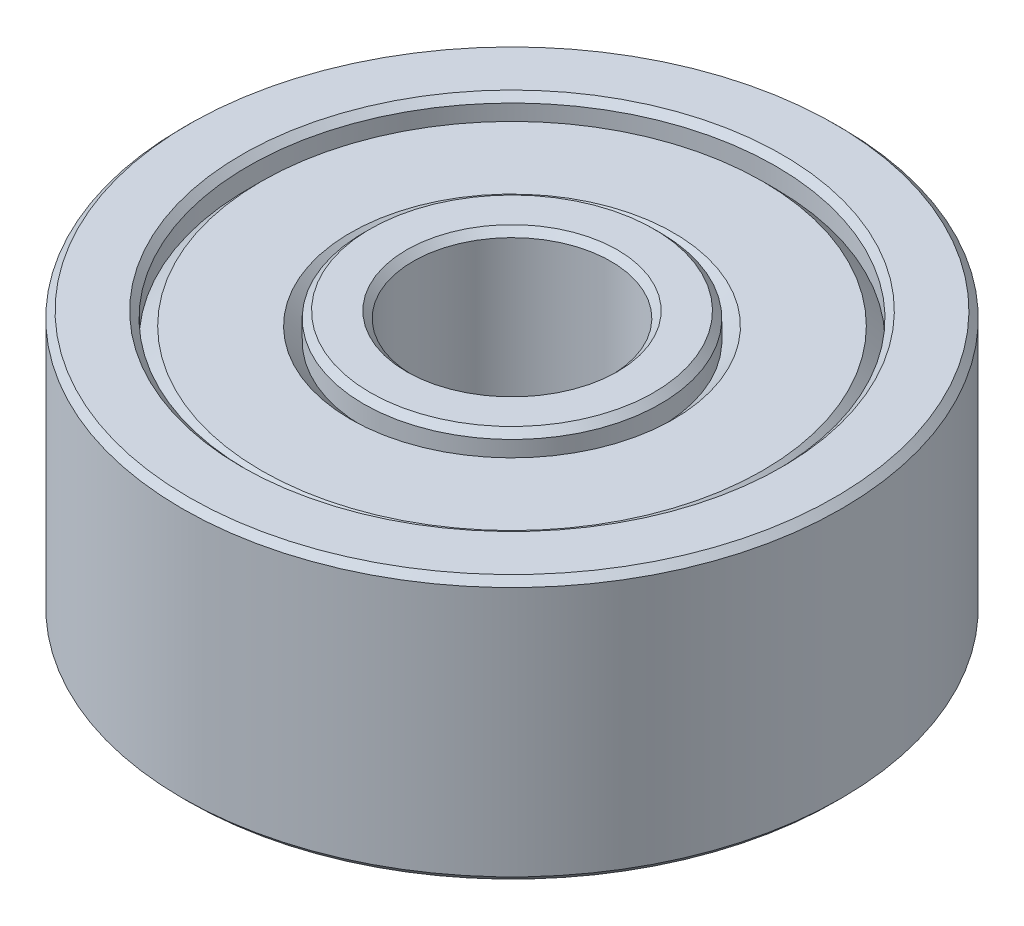
ISO-10303-21;
HEADER;
FILE_DESCRIPTION(('STEP AP214'),'2;1');
FILE_NAME('part.step','',(''),(''),'','','');
FILE_SCHEMA(('AUTOMOTIVE_DESIGN { 1 0 10303 214 1 1 1 1 }'));
ENDSEC;
DATA;
#1=APPLICATION_CONTEXT('core data for automotive mechanical design processes');
#2=APPLICATION_PROTOCOL_DEFINITION('international standard','automotive_design',2000,#1);
#3=PRODUCT_CONTEXT('',#1,'mechanical');
#4=PRODUCT('Part','Part','',(#3));
#5=PRODUCT_RELATED_PRODUCT_CATEGORY('part','',(#4));
#6=PRODUCT_DEFINITION_FORMATION('','',#4);
#7=PRODUCT_DEFINITION_CONTEXT('part definition',#1,'design');
#8=PRODUCT_DEFINITION('design','',#6,#7);
#9=PRODUCT_DEFINITION_SHAPE('','',#8);
#10=(LENGTH_UNIT() NAMED_UNIT(*) SI_UNIT(.MILLI.,.METRE.));
#11=(NAMED_UNIT(*) PLANE_ANGLE_UNIT() SI_UNIT($,.RADIAN.));
#12=(NAMED_UNIT(*) SI_UNIT($,.STERADIAN.) SOLID_ANGLE_UNIT());
#13=UNCERTAINTY_MEASURE_WITH_UNIT(LENGTH_MEASURE(1.E-05),#10,'distance_accuracy_value','');
#14=(GEOMETRIC_REPRESENTATION_CONTEXT(3) GLOBAL_UNCERTAINTY_ASSIGNED_CONTEXT((#13)) GLOBAL_UNIT_ASSIGNED_CONTEXT((#10,
#11,#12)) REPRESENTATION_CONTEXT('',''));
#15=CARTESIAN_POINT('',(0.,0.,0.));
#16=DIRECTION('',(0.,0.,1.));
#17=DIRECTION('',(1.,0.,0.));
#18=AXIS2_PLACEMENT_3D('',#15,#16,#17);
#19=CARTESIAN_POINT('',(0.,-2.,0.));
#20=DIRECTION('',(0.,1.,0.));
#21=DIRECTION('',(0.,0.,1.));
#22=AXIS2_PLACEMENT_3D('',#19,#20,#21);
#23=PLANE('',#22);
#24=CARTESIAN_POINT('',(0.,-2.,0.));
#25=DIRECTION('',(0.,1.,0.));
#26=DIRECTION('',(0.,0.,1.));
#27=AXIS2_PLACEMENT_3D('',#24,#25,#26);
#28=CIRCLE('',#27,4.10000000000001);
#29=CARTESIAN_POINT('',(0.,-2.,4.10000000000001));
#30=VERTEX_POINT('',#29);
#31=EDGE_CURVE('E60',#30,#30,#28,.T.);
#32=ORIENTED_EDGE('',*,*,#31,.T.);
#33=EDGE_LOOP('',(#32));
#34=FACE_BOUND('',#33,.T.);
#35=CARTESIAN_POINT('',(0.,-2.,0.));
#36=DIRECTION('',(0.,1.,0.));
#37=DIRECTION('',(0.,0.,1.));
#38=AXIS2_PLACEMENT_3D('',#35,#36,#37);
#39=CIRCLE('',#38,4.9);
#40=CARTESIAN_POINT('',(0.,-2.,4.9));
#41=VERTEX_POINT('',#40);
#42=EDGE_CURVE('E63',#41,#41,#39,.F.);
#43=ORIENTED_EDGE('',*,*,#42,.T.);
#44=EDGE_LOOP('',(#43));
#45=FACE_BOUND('',#44,.T.);
#46=ADVANCED_FACE('F34',(#34,#45),#23,.F.);
#47=CARTESIAN_POINT('',(0.,-2.,0.));
#48=DIRECTION('',(0.,1.,0.));
#49=DIRECTION('',(0.,0.,1.));
#50=AXIS2_PLACEMENT_3D('',#47,#48,#49);
#51=CIRCLE('',#50,1.6);
#52=CARTESIAN_POINT('',(0.,-2.,1.6));
#53=VERTEX_POINT('',#52);
#54=EDGE_CURVE('E84',#53,#53,#51,.T.);
#55=ORIENTED_EDGE('',*,*,#54,.T.);
#56=EDGE_LOOP('',(#55));
#57=FACE_BOUND('',#56,.T.);
#58=CARTESIAN_POINT('',(0.,-2.,0.));
#59=DIRECTION('',(0.,1.,0.));
#60=DIRECTION('',(0.,0.,1.));
#61=AXIS2_PLACEMENT_3D('',#58,#59,#60);
#62=CIRCLE('',#61,2.15);
#63=CARTESIAN_POINT('',(0.,-2.,2.15));
#64=VERTEX_POINT('',#63);
#65=EDGE_CURVE('E87',#64,#64,#62,.F.);
#66=ORIENTED_EDGE('',*,*,#65,.T.);
#67=EDGE_LOOP('',(#66));
#68=FACE_BOUND('',#67,.T.);
#69=ADVANCED_FACE('F141',(#57,#68),#23,.F.);
#70=CARTESIAN_POINT('',(0.,2.,0.));
#71=DIRECTION('',(0.,1.,0.));
#72=DIRECTION('',(0.,0.,1.));
#73=AXIS2_PLACEMENT_3D('',#70,#71,#72);
#74=PLANE('',#73);
#75=CARTESIAN_POINT('',(0.,2.,0.));
#76=DIRECTION('',(0.,1.,0.));
#77=DIRECTION('',(0.,0.,1.));
#78=AXIS2_PLACEMENT_3D('',#75,#76,#77);
#79=CIRCLE('',#78,4.1);
#80=CARTESIAN_POINT('',(0.,2.,4.1));
#81=VERTEX_POINT('',#80);
#82=EDGE_CURVE('E45',#81,#81,#79,.F.);
#83=ORIENTED_EDGE('',*,*,#82,.T.);
#84=EDGE_LOOP('',(#83));
#85=FACE_BOUND('',#84,.T.);
#86=CARTESIAN_POINT('',(0.,2.,0.));
#87=DIRECTION('',(0.,1.,0.));
#88=DIRECTION('',(0.,0.,1.));
#89=AXIS2_PLACEMENT_3D('',#86,#87,#88);
#90=CIRCLE('',#89,4.9);
#91=CARTESIAN_POINT('',(0.,2.,4.9));
#92=VERTEX_POINT('',#91);
#93=EDGE_CURVE('E49',#92,#92,#90,.T.);
#94=ORIENTED_EDGE('',*,*,#93,.T.);
#95=EDGE_LOOP('',(#94));
#96=FACE_BOUND('',#95,.T.);
#97=ADVANCED_FACE('F147',(#85,#96),#74,.T.);
#98=CARTESIAN_POINT('',(0.,2.,0.));
#99=DIRECTION('',(0.,1.,0.));
#100=DIRECTION('',(0.,0.,1.));
#101=AXIS2_PLACEMENT_3D('',#98,#99,#100);
#102=CIRCLE('',#101,1.6);
#103=CARTESIAN_POINT('',(0.,2.,1.6));
#104=VERTEX_POINT('',#103);
#105=EDGE_CURVE('E72',#104,#104,#102,.F.);
#106=ORIENTED_EDGE('',*,*,#105,.T.);
#107=EDGE_LOOP('',(#106));
#108=FACE_BOUND('',#107,.T.);
#109=CARTESIAN_POINT('',(0.,2.,0.));
#110=DIRECTION('',(0.,1.,0.));
#111=DIRECTION('',(0.,0.,1.));
#112=AXIS2_PLACEMENT_3D('',#109,#110,#111);
#113=CIRCLE('',#112,2.15);
#114=CARTESIAN_POINT('',(0.,2.,2.15));
#115=VERTEX_POINT('',#114);
#116=EDGE_CURVE('E75',#115,#115,#113,.T.);
#117=ORIENTED_EDGE('',*,*,#116,.T.);
#118=EDGE_LOOP('',(#117));
#119=FACE_BOUND('',#118,.T.);
#120=ADVANCED_FACE('F157',(#108,#119),#74,.T.);
#121=CARTESIAN_POINT('',(0.,2.,0.));
#122=DIRECTION('',(0.,1.,0.));
#123=DIRECTION('',(0.,0.,1.));
#124=AXIS2_PLACEMENT_3D('',#121,#122,#123);
#125=CYLINDRICAL_SURFACE('',#124,1.5);
#126=CARTESIAN_POINT('',(0.,-1.9,0.));
#127=DIRECTION('',(0.,1.,0.));
#128=DIRECTION('',(0.,0.,1.));
#129=AXIS2_PLACEMENT_3D('',#126,#127,#128);
#130=CIRCLE('',#129,1.5);
#131=CARTESIAN_POINT('',(0.,-1.9,1.5));
#132=VERTEX_POINT('',#131);
#133=EDGE_CURVE('E78',#132,#132,#130,.F.);
#134=ORIENTED_EDGE('',*,*,#133,.T.);
#135=EDGE_LOOP('',(#134));
#136=FACE_BOUND('',#135,.T.);
#137=CARTESIAN_POINT('',(0.,1.9,0.));
#138=DIRECTION('',(0.,1.,0.));
#139=DIRECTION('',(0.,0.,1.));
#140=AXIS2_PLACEMENT_3D('',#137,#138,#139);
#141=CIRCLE('',#140,1.5);
#142=CARTESIAN_POINT('',(0.,1.9,1.5));
#143=VERTEX_POINT('',#142);
#144=EDGE_CURVE('E81',#143,#143,#141,.T.);
#145=ORIENTED_EDGE('',*,*,#144,.T.);
#146=EDGE_LOOP('',(#145));
#147=FACE_BOUND('',#146,.T.);
#148=ADVANCED_FACE('F154',(#136,#147),#125,.F.);
#149=CARTESIAN_POINT('',(0.,2.,0.));
#150=DIRECTION('',(0.,1.,0.));
#151=DIRECTION('',(0.,0.,1.));
#152=AXIS2_PLACEMENT_3D('',#149,#150,#151);
#153=CYLINDRICAL_SURFACE('',#152,5.);
#154=CARTESIAN_POINT('',(0.,-1.9,0.));
#155=DIRECTION('',(0.,1.,0.));
#156=DIRECTION('',(0.,0.,1.));
#157=AXIS2_PLACEMENT_3D('',#154,#155,#156);
#158=CIRCLE('',#157,5.);
#159=CARTESIAN_POINT('',(0.,-1.9,5.));
#160=VERTEX_POINT('',#159);
#161=EDGE_CURVE('E10',#160,#160,#158,.T.);
#162=ORIENTED_EDGE('',*,*,#161,.T.);
#163=EDGE_LOOP('',(#162));
#164=FACE_BOUND('',#163,.T.);
#165=CARTESIAN_POINT('',(0.,1.9,0.));
#166=DIRECTION('',(0.,1.,0.));
#167=DIRECTION('',(0.,0.,1.));
#168=AXIS2_PLACEMENT_3D('',#165,#166,#167);
#169=CIRCLE('',#168,5.);
#170=CARTESIAN_POINT('',(0.,1.9,5.));
#171=VERTEX_POINT('',#170);
#172=EDGE_CURVE('E41',#171,#171,#169,.F.);
#173=ORIENTED_EDGE('',*,*,#172,.T.);
#174=EDGE_LOOP('',(#173));
#175=FACE_BOUND('',#174,.T.);
#176=ADVANCED_FACE('F152',(#164,#175),#153,.T.);
#177=CARTESIAN_POINT('',(0.,1.8,0.));
#178=DIRECTION('',(0.,-1.,0.));
#179=DIRECTION('',(0.,0.,-1.));
#180=AXIS2_PLACEMENT_3D('',#177,#178,#179);
#181=CONICAL_SURFACE('',#180,3.8,0.785398163397448);
#182=CARTESIAN_POINT('',(0.,1.6,0.));
#183=DIRECTION('',(0.,1.,0.));
#184=DIRECTION('',(0.,0.,1.));
#185=AXIS2_PLACEMENT_3D('',#182,#183,#184);
#186=CIRCLE('',#185,4.);
#187=CARTESIAN_POINT('',(0.,1.6,4.));
#188=VERTEX_POINT('',#187);
#189=EDGE_CURVE('E90',#188,#188,#186,.T.);
#190=ORIENTED_EDGE('',*,*,#189,.T.);
#191=EDGE_LOOP('',(#190));
#192=FACE_BOUND('',#191,.T.);
#193=CARTESIAN_POINT('',(0.,1.8,0.));
#194=DIRECTION('',(0.,1.,0.));
#195=DIRECTION('',(0.,0.,1.));
#196=AXIS2_PLACEMENT_3D('',#193,#194,#195);
#197=CIRCLE('',#196,3.8);
#198=CARTESIAN_POINT('',(0.,1.8,3.8));
#199=VERTEX_POINT('',#198);
#200=EDGE_CURVE('E99',#199,#199,#197,.T.);
#201=ORIENTED_EDGE('',*,*,#200,.F.);
#202=EDGE_LOOP('',(#201));
#203=FACE_BOUND('',#202,.T.);
#204=ADVANCED_FACE('F275',(#192,#203),#181,.T.);
#205=CARTESIAN_POINT('',(0.,2.,0.));
#206=DIRECTION('',(0.,1.,0.));
#207=DIRECTION('',(0.,0.,1.));
#208=AXIS2_PLACEMENT_3D('',#205,#206,#207);
#209=CYLINDRICAL_SURFACE('',#208,4.);
#210=CARTESIAN_POINT('',(0.,1.9,0.));
#211=DIRECTION('',(0.,1.,0.));
#212=DIRECTION('',(0.,0.,1.));
#213=AXIS2_PLACEMENT_3D('',#210,#211,#212);
#214=CIRCLE('',#213,4.);
#215=CARTESIAN_POINT('',(0.,1.9,4.));
#216=VERTEX_POINT('',#215);
#217=EDGE_CURVE('E54',#216,#216,#214,.T.);
#218=ORIENTED_EDGE('',*,*,#217,.T.);
#219=EDGE_LOOP('',(#218));
#220=FACE_BOUND('',#219,.T.);
#221=ORIENTED_EDGE('',*,*,#189,.F.);
#222=EDGE_LOOP('',(#221));
#223=FACE_BOUND('',#222,.T.);
#224=ADVANCED_FACE('F263',(#220,#223),#209,.F.);
#225=CARTESIAN_POINT('',(0.,2.,0.));
#226=DIRECTION('',(0.,1.,0.));
#227=DIRECTION('',(0.,0.,1.));
#228=AXIS2_PLACEMENT_3D('',#225,#226,#227);
#229=CYLINDRICAL_SURFACE('',#228,2.25);
#230=CARTESIAN_POINT('',(0.,1.9,0.));
#231=DIRECTION('',(0.,1.,0.));
#232=DIRECTION('',(0.,0.,1.));
#233=AXIS2_PLACEMENT_3D('',#230,#231,#232);
#234=CIRCLE('',#233,2.25);
#235=CARTESIAN_POINT('',(0.,1.9,2.25));
#236=VERTEX_POINT('',#235);
#237=EDGE_CURVE('E66',#236,#236,#234,.F.);
#238=ORIENTED_EDGE('',*,*,#237,.T.);
#239=EDGE_LOOP('',(#238));
#240=FACE_BOUND('',#239,.T.);
#241=CARTESIAN_POINT('',(0.,1.6,0.));
#242=DIRECTION('',(0.,1.,0.));
#243=DIRECTION('',(0.,0.,1.));
#244=AXIS2_PLACEMENT_3D('',#241,#242,#243);
#245=CIRCLE('',#244,2.25);
#246=CARTESIAN_POINT('',(0.,1.6,2.25));
#247=VERTEX_POINT('',#246);
#248=EDGE_CURVE('E93',#247,#247,#245,.T.);
#249=ORIENTED_EDGE('',*,*,#248,.T.);
#250=EDGE_LOOP('',(#249));
#251=FACE_BOUND('',#250,.T.);
#252=ADVANCED_FACE('F257',(#240,#251),#229,.T.);
#253=CARTESIAN_POINT('',(0.,1.6,0.));
#254=DIRECTION('',(0.,1.,0.));
#255=DIRECTION('',(0.,0.,1.));
#256=AXIS2_PLACEMENT_3D('',#253,#254,#255);
#257=CONICAL_SURFACE('',#256,2.25,0.785398163397449);
#258=CARTESIAN_POINT('',(0.,1.8,0.));
#259=DIRECTION('',(0.,1.,0.));
#260=DIRECTION('',(0.,0.,1.));
#261=AXIS2_PLACEMENT_3D('',#258,#259,#260);
#262=CIRCLE('',#261,2.45);
#263=CARTESIAN_POINT('',(0.,1.8,2.45));
#264=VERTEX_POINT('',#263);
#265=EDGE_CURVE('E96',#264,#264,#262,.T.);
#266=ORIENTED_EDGE('',*,*,#265,.T.);
#267=EDGE_LOOP('',(#266));
#268=FACE_BOUND('',#267,.T.);
#269=ORIENTED_EDGE('',*,*,#248,.F.);
#270=EDGE_LOOP('',(#269));
#271=FACE_BOUND('',#270,.T.);
#272=ADVANCED_FACE('F262',(#268,#271),#257,.F.);
#273=CARTESIAN_POINT('',(0.,1.8,0.));
#274=DIRECTION('',(0.,1.,0.));
#275=DIRECTION('',(0.,0.,1.));
#276=AXIS2_PLACEMENT_3D('',#273,#274,#275);
#277=PLANE('',#276);
#278=ORIENTED_EDGE('',*,*,#200,.T.);
#279=EDGE_LOOP('',(#278));
#280=FACE_BOUND('',#279,.T.);
#281=ORIENTED_EDGE('',*,*,#265,.F.);
#282=EDGE_LOOP('',(#281));
#283=FACE_BOUND('',#282,.T.);
#284=ADVANCED_FACE('F338',(#280,#283),#277,.T.);
#285=CARTESIAN_POINT('',(0.,-1.8,0.));
#286=DIRECTION('',(0.,1.,0.));
#287=DIRECTION('',(0.,0.,-1.));
#288=AXIS2_PLACEMENT_3D('',#285,#286,#287);
#289=CONICAL_SURFACE('',#288,3.8,0.785398163397448);
#290=CARTESIAN_POINT('',(0.,-1.6,0.));
#291=DIRECTION('',(0.,1.,0.));
#292=DIRECTION('',(0.,0.,1.));
#293=AXIS2_PLACEMENT_3D('',#290,#291,#292);
#294=CIRCLE('',#293,4.);
#295=CARTESIAN_POINT('',(0.,-1.6,4.));
#296=VERTEX_POINT('',#295);
#297=EDGE_CURVE('E102',#296,#296,#294,.T.);
#298=ORIENTED_EDGE('',*,*,#297,.F.);
#299=EDGE_LOOP('',(#298));
#300=FACE_BOUND('',#299,.T.);
#301=CARTESIAN_POINT('',(0.,-1.8,0.));
#302=DIRECTION('',(0.,1.,0.));
#303=DIRECTION('',(0.,0.,1.));
#304=AXIS2_PLACEMENT_3D('',#301,#302,#303);
#305=CIRCLE('',#304,3.8);
#306=CARTESIAN_POINT('',(0.,-1.8,3.8));
#307=VERTEX_POINT('',#306);
#308=EDGE_CURVE('E111',#307,#307,#305,.T.);
#309=ORIENTED_EDGE('',*,*,#308,.T.);
#310=EDGE_LOOP('',(#309));
#311=FACE_BOUND('',#310,.T.);
#312=ADVANCED_FACE('F115',(#300,#311),#289,.T.);
#313=CARTESIAN_POINT('',(0.,-2.,0.));
#314=DIRECTION('',(0.,-1.,0.));
#315=DIRECTION('',(0.,0.,1.));
#316=AXIS2_PLACEMENT_3D('',#313,#314,#315);
#317=CYLINDRICAL_SURFACE('',#316,4.);
#318=CARTESIAN_POINT('',(0.,-1.9,0.));
#319=DIRECTION('',(0.,1.,0.));
#320=DIRECTION('',(0.,0.,1.));
#321=AXIS2_PLACEMENT_3D('',#318,#319,#320);
#322=CIRCLE('',#321,4.);
#323=CARTESIAN_POINT('',(0.,-1.9,4.));
#324=VERTEX_POINT('',#323);
#325=EDGE_CURVE('E57',#324,#324,#322,.F.);
#326=ORIENTED_EDGE('',*,*,#325,.T.);
#327=EDGE_LOOP('',(#326));
#328=FACE_BOUND('',#327,.T.);
#329=ORIENTED_EDGE('',*,*,#297,.T.);
#330=EDGE_LOOP('',(#329));
#331=FACE_BOUND('',#330,.T.);
#332=ADVANCED_FACE('F132',(#328,#331),#317,.F.);
#333=CARTESIAN_POINT('',(0.,-2.,0.));
#334=DIRECTION('',(0.,-1.,0.));
#335=DIRECTION('',(0.,0.,1.));
#336=AXIS2_PLACEMENT_3D('',#333,#334,#335);
#337=CYLINDRICAL_SURFACE('',#336,2.25);
#338=CARTESIAN_POINT('',(0.,-1.9,0.));
#339=DIRECTION('',(0.,1.,0.));
#340=DIRECTION('',(0.,0.,1.));
#341=AXIS2_PLACEMENT_3D('',#338,#339,#340);
#342=CIRCLE('',#341,2.25);
#343=CARTESIAN_POINT('',(0.,-1.9,2.25));
#344=VERTEX_POINT('',#343);
#345=EDGE_CURVE('E69',#344,#344,#342,.T.);
#346=ORIENTED_EDGE('',*,*,#345,.T.);
#347=EDGE_LOOP('',(#346));
#348=FACE_BOUND('',#347,.T.);
#349=CARTESIAN_POINT('',(0.,-1.6,0.));
#350=DIRECTION('',(0.,1.,0.));
#351=DIRECTION('',(0.,0.,1.));
#352=AXIS2_PLACEMENT_3D('',#349,#350,#351);
#353=CIRCLE('',#352,2.25);
#354=CARTESIAN_POINT('',(0.,-1.6,2.25));
#355=VERTEX_POINT('',#354);
#356=EDGE_CURVE('E105',#355,#355,#353,.T.);
#357=ORIENTED_EDGE('',*,*,#356,.F.);
#358=EDGE_LOOP('',(#357));
#359=FACE_BOUND('',#358,.T.);
#360=ADVANCED_FACE('F127',(#348,#359),#337,.T.);
#361=CARTESIAN_POINT('',(0.,-1.6,0.));
#362=DIRECTION('',(0.,-1.,0.));
#363=DIRECTION('',(0.,0.,1.));
#364=AXIS2_PLACEMENT_3D('',#361,#362,#363);
#365=CONICAL_SURFACE('',#364,2.25,0.785398163397449);
#366=CARTESIAN_POINT('',(0.,-1.8,0.));
#367=DIRECTION('',(0.,1.,0.));
#368=DIRECTION('',(0.,0.,1.));
#369=AXIS2_PLACEMENT_3D('',#366,#367,#368);
#370=CIRCLE('',#369,2.45);
#371=CARTESIAN_POINT('',(0.,-1.8,2.45));
#372=VERTEX_POINT('',#371);
#373=EDGE_CURVE('E108',#372,#372,#370,.T.);
#374=ORIENTED_EDGE('',*,*,#373,.F.);
#375=EDGE_LOOP('',(#374));
#376=FACE_BOUND('',#375,.T.);
#377=ORIENTED_EDGE('',*,*,#356,.T.);
#378=EDGE_LOOP('',(#377));
#379=FACE_BOUND('',#378,.T.);
#380=ADVANCED_FACE('F121',(#376,#379),#365,.F.);
#381=CARTESIAN_POINT('',(0.,-1.8,0.));
#382=DIRECTION('',(0.,-1.,0.));
#383=DIRECTION('',(0.,0.,1.));
#384=AXIS2_PLACEMENT_3D('',#381,#382,#383);
#385=PLANE('',#384);
#386=ORIENTED_EDGE('',*,*,#308,.F.);
#387=EDGE_LOOP('',(#386));
#388=FACE_BOUND('',#387,.T.);
#389=ORIENTED_EDGE('',*,*,#373,.T.);
#390=EDGE_LOOP('',(#389));
#391=FACE_BOUND('',#390,.T.);
#392=ADVANCED_FACE('F117',(#388,#391),#385,.T.);
#393=CARTESIAN_POINT('',(0.,-2.,0.));
#394=DIRECTION('',(0.,-1.,0.));
#395=DIRECTION('',(0.,0.,-1.));
#396=AXIS2_PLACEMENT_3D('',#393,#394,#395);
#397=CONICAL_SURFACE('',#396,1.6,0.785398163397454);
#398=ORIENTED_EDGE('',*,*,#133,.F.);
#399=EDGE_LOOP('',(#398));
#400=FACE_BOUND('',#399,.T.);
#401=ORIENTED_EDGE('',*,*,#54,.F.);
#402=EDGE_LOOP('',(#401));
#403=FACE_BOUND('',#402,.T.);
#404=ADVANCED_FACE('F120',(#400,#403),#397,.F.);
#405=CARTESIAN_POINT('',(0.,1.9,0.));
#406=DIRECTION('',(0.,1.,0.));
#407=DIRECTION('',(0.,0.,1.));
#408=AXIS2_PLACEMENT_3D('',#405,#406,#407);
#409=CONICAL_SURFACE('',#408,1.5,0.78539816339745);
#410=ORIENTED_EDGE('',*,*,#105,.F.);
#411=EDGE_LOOP('',(#410));
#412=FACE_BOUND('',#411,.T.);
#413=ORIENTED_EDGE('',*,*,#144,.F.);
#414=EDGE_LOOP('',(#413));
#415=FACE_BOUND('',#414,.T.);
#416=ADVANCED_FACE('F164',(#412,#415),#409,.F.);
#417=CARTESIAN_POINT('',(0.,-1.9,0.));
#418=DIRECTION('',(0.,1.,0.));
#419=DIRECTION('',(0.,0.,1.));
#420=AXIS2_PLACEMENT_3D('',#417,#418,#419);
#421=CONICAL_SURFACE('',#420,2.25,0.785398163397446);
#422=ORIENTED_EDGE('',*,*,#65,.F.);
#423=EDGE_LOOP('',(#422));
#424=FACE_BOUND('',#423,.T.);
#425=ORIENTED_EDGE('',*,*,#345,.F.);
#426=EDGE_LOOP('',(#425));
#427=FACE_BOUND('',#426,.T.);
#428=ADVANCED_FACE('F168',(#424,#427),#421,.T.);
#429=CARTESIAN_POINT('',(0.,2.,0.));
#430=DIRECTION('',(0.,-1.,0.));
#431=DIRECTION('',(0.,0.,-1.));
#432=AXIS2_PLACEMENT_3D('',#429,#430,#431);
#433=CONICAL_SURFACE('',#432,2.15,0.78539816339745);
#434=ORIENTED_EDGE('',*,*,#237,.F.);
#435=EDGE_LOOP('',(#434));
#436=FACE_BOUND('',#435,.T.);
#437=ORIENTED_EDGE('',*,*,#116,.F.);
#438=EDGE_LOOP('',(#437));
#439=FACE_BOUND('',#438,.T.);
#440=ADVANCED_FACE('F172',(#436,#439),#433,.T.);
#441=CARTESIAN_POINT('',(0.,-2.,0.));
#442=DIRECTION('',(0.,-1.,0.));
#443=DIRECTION('',(0.,0.,-1.));
#444=AXIS2_PLACEMENT_3D('',#441,#442,#443);
#445=CONICAL_SURFACE('',#444,4.1,0.785398163397453);
#446=ORIENTED_EDGE('',*,*,#325,.F.);
#447=EDGE_LOOP('',(#446));
#448=FACE_BOUND('',#447,.T.);
#449=ORIENTED_EDGE('',*,*,#31,.F.);
#450=EDGE_LOOP('',(#449));
#451=FACE_BOUND('',#450,.T.);
#452=ADVANCED_FACE('F176',(#448,#451),#445,.F.);
#453=CARTESIAN_POINT('',(0.,1.9,0.));
#454=DIRECTION('',(0.,1.,0.));
#455=DIRECTION('',(0.,0.,1.));
#456=AXIS2_PLACEMENT_3D('',#453,#454,#455);
#457=CONICAL_SURFACE('',#456,4.,0.785398163397453);
#458=ORIENTED_EDGE('',*,*,#82,.F.);
#459=EDGE_LOOP('',(#458));
#460=FACE_BOUND('',#459,.T.);
#461=ORIENTED_EDGE('',*,*,#217,.F.);
#462=EDGE_LOOP('',(#461));
#463=FACE_BOUND('',#462,.T.);
#464=ADVANCED_FACE('F180',(#460,#463),#457,.F.);
#465=CARTESIAN_POINT('',(0.,-1.9,0.));
#466=DIRECTION('',(0.,1.,0.));
#467=DIRECTION('',(0.,0.,1.));
#468=AXIS2_PLACEMENT_3D('',#465,#466,#467);
#469=CONICAL_SURFACE('',#468,5.,0.785398163397457);
#470=ORIENTED_EDGE('',*,*,#42,.F.);
#471=EDGE_LOOP('',(#470));
#472=FACE_BOUND('',#471,.T.);
#473=ORIENTED_EDGE('',*,*,#161,.F.);
#474=EDGE_LOOP('',(#473));
#475=FACE_BOUND('',#474,.T.);
#476=ADVANCED_FACE('F183',(#472,#475),#469,.T.);
#477=CARTESIAN_POINT('',(0.,2.,0.));
#478=DIRECTION('',(0.,-1.,0.));
#479=DIRECTION('',(0.,0.,-1.));
#480=AXIS2_PLACEMENT_3D('',#477,#478,#479);
#481=CONICAL_SURFACE('',#480,4.9,0.785398163397448);
#482=ORIENTED_EDGE('',*,*,#172,.F.);
#483=EDGE_LOOP('',(#482));
#484=FACE_BOUND('',#483,.T.);
#485=ORIENTED_EDGE('',*,*,#93,.F.);
#486=EDGE_LOOP('',(#485));
#487=FACE_BOUND('',#486,.T.);
#488=ADVANCED_FACE('F36',(#484,#487),#481,.T.);
#489=CLOSED_SHELL('',(#46,#69,#97,#120,#148,#176,#204,#224,#252,#272,#284,#312,#332,#360,#380,
#392,#404,#416,#428,#440,#452,#464,#476,#488));
#490=MANIFOLD_SOLID_BREP('B2',#489);
#491=ADVANCED_BREP_SHAPE_REPRESENTATION('',(#18,#490),#14);
#492=SHAPE_DEFINITION_REPRESENTATION(#9,#491);
ENDSEC;
END-ISO-10303-21;
